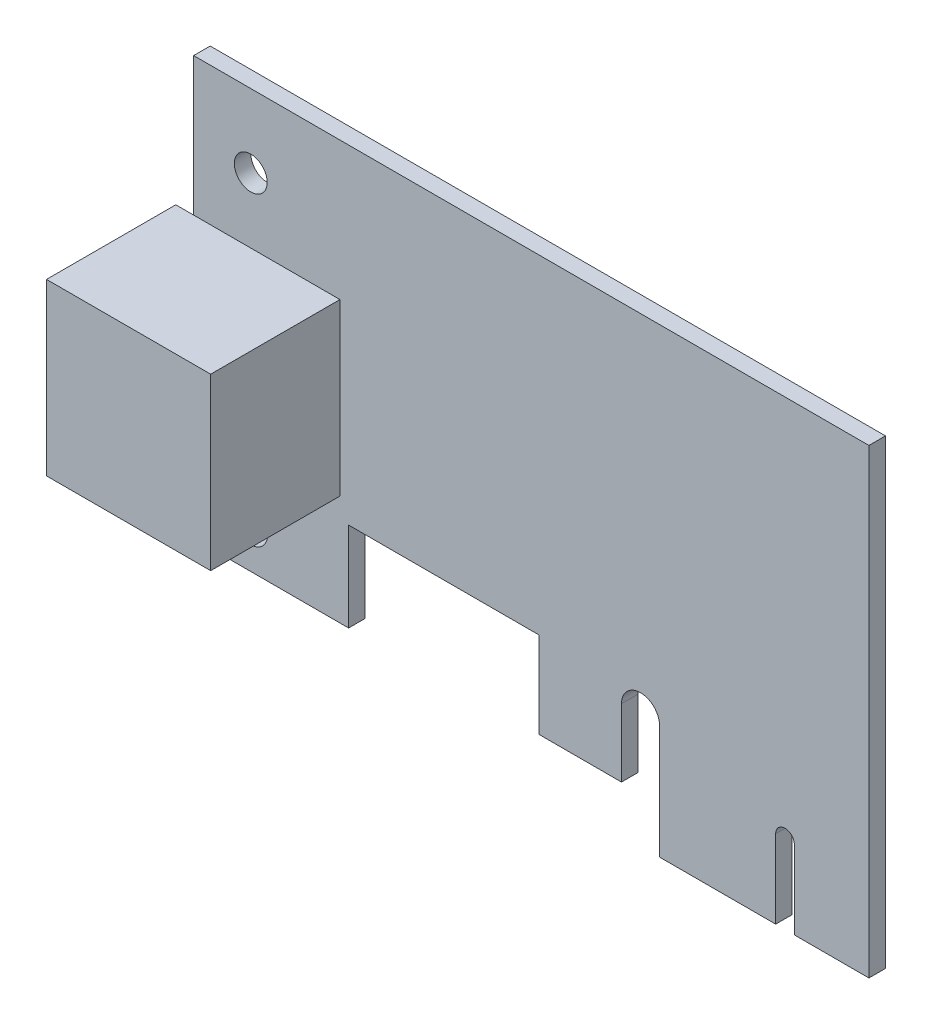
ISO-10303-21;
HEADER;
FILE_DESCRIPTION(('STEP AP214'),'2;1');
FILE_NAME('part.step','',(''),(''),'','','');
FILE_SCHEMA(('AUTOMOTIVE_DESIGN { 1 0 10303 214 1 1 1 1 }'));
ENDSEC;
DATA;
#1=APPLICATION_CONTEXT('core data for automotive mechanical design processes');
#2=APPLICATION_PROTOCOL_DEFINITION('international standard','automotive_design',2000,#1);
#3=PRODUCT_CONTEXT('',#1,'mechanical');
#4=PRODUCT('Part','Part','',(#3));
#5=PRODUCT_RELATED_PRODUCT_CATEGORY('part','',(#4));
#6=PRODUCT_DEFINITION_FORMATION('','',#4);
#7=PRODUCT_DEFINITION_CONTEXT('part definition',#1,'design');
#8=PRODUCT_DEFINITION('design','',#6,#7);
#9=PRODUCT_DEFINITION_SHAPE('','',#8);
#10=(LENGTH_UNIT() NAMED_UNIT(*) SI_UNIT(.MILLI.,.METRE.));
#11=(NAMED_UNIT(*) PLANE_ANGLE_UNIT() SI_UNIT($,.RADIAN.));
#12=(NAMED_UNIT(*) SI_UNIT($,.STERADIAN.) SOLID_ANGLE_UNIT());
#13=UNCERTAINTY_MEASURE_WITH_UNIT(LENGTH_MEASURE(1.E-05),#10,'distance_accuracy_value','');
#14=(GEOMETRIC_REPRESENTATION_CONTEXT(3) GLOBAL_UNCERTAINTY_ASSIGNED_CONTEXT((#13)) GLOBAL_UNIT_ASSIGNED_CONTEXT((#10,
#11,#12)) REPRESENTATION_CONTEXT('',''));
#15=CARTESIAN_POINT('',(0.,0.,0.));
#16=DIRECTION('',(0.,0.,1.));
#17=DIRECTION('',(1.,0.,0.));
#18=AXIS2_PLACEMENT_3D('',#15,#16,#17);
#19=CARTESIAN_POINT('',(43.2181,11.0109,1.6));
#20=DIRECTION('',(0.,0.,1.));
#21=DIRECTION('',(1.,0.,0.));
#22=AXIS2_PLACEMENT_3D('',#19,#20,#21);
#23=PLANE('',#22);
#24=DIRECTION('',(-1.,0.,0.));
#25=VECTOR('',#24,1.);
#26=CARTESIAN_POINT('',(-1.7272,31.242,1.6));
#27=LINE('',#26,#25);
#28=CARTESIAN_POINT('',(14.1478,31.242,1.6));
#29=VERTEX_POINT('',#28);
#30=CARTESIAN_POINT('',(0.,31.242,1.6));
#31=VERTEX_POINT('',#30);
#32=EDGE_CURVE('E65',#29,#31,#27,.T.);
#33=ORIENTED_EDGE('',*,*,#32,.F.);
#34=DIRECTION('',(0.,1.,0.));
#35=VECTOR('',#34,1.);
#36=CARTESIAN_POINT('',(14.1478,31.242,1.6));
#37=LINE('',#36,#35);
#38=CARTESIAN_POINT('',(14.1478,14.7828,1.6));
#39=VERTEX_POINT('',#38);
#40=EDGE_CURVE('E478',#39,#29,#37,.T.);
#41=ORIENTED_EDGE('',*,*,#40,.F.);
#42=DIRECTION('',(1.,0.,0.));
#43=VECTOR('',#42,1.);
#44=CARTESIAN_POINT('',(-1.7272,14.7828,1.6));
#45=LINE('',#44,#43);
#46=CARTESIAN_POINT('',(0.,14.7828,1.6));
#47=VERTEX_POINT('',#46);
#48=EDGE_CURVE('E11',#47,#39,#45,.T.);
#49=ORIENTED_EDGE('',*,*,#48,.F.);
#50=DIRECTION('',(0.,-1.,0.));
#51=VECTOR('',#50,1.);
#52=CARTESIAN_POINT('',(0.,4.15289999999999,1.6));
#53=LINE('',#52,#51);
#54=CARTESIAN_POINT('',(0.,4.15289999999999,1.6));
#55=VERTEX_POINT('',#54);
#56=EDGE_CURVE('E290',#47,#55,#53,.T.);
#57=ORIENTED_EDGE('',*,*,#56,.T.);
#58=DIRECTION('',(1.,0.,0.));
#59=VECTOR('',#58,1.);
#60=CARTESIAN_POINT('',(0.,4.15289999999999,1.6));
#61=LINE('',#60,#59);
#62=CARTESIAN_POINT('',(14.986,4.15289999999999,1.6));
#63=VERTEX_POINT('',#62);
#64=EDGE_CURVE('E294',#55,#63,#61,.T.);
#65=ORIENTED_EDGE('',*,*,#64,.T.);
#66=DIRECTION('',(0.,1.,0.));
#67=VECTOR('',#66,1.);
#68=CARTESIAN_POINT('',(14.986,4.15289999999999,1.6));
#69=LINE('',#68,#67);
#70=CARTESIAN_POINT('',(14.986,12.7762,1.6));
#71=VERTEX_POINT('',#70);
#72=EDGE_CURVE('E298',#63,#71,#69,.T.);
#73=ORIENTED_EDGE('',*,*,#72,.T.);
#74=DIRECTION('',(1.,0.,0.));
#75=VECTOR('',#74,1.);
#76=CARTESIAN_POINT('',(14.986,12.7762,1.6));
#77=LINE('',#76,#75);
#78=CARTESIAN_POINT('',(33.3756,12.7762,1.6));
#79=VERTEX_POINT('',#78);
#80=EDGE_CURVE('E301',#71,#79,#77,.T.);
#81=ORIENTED_EDGE('',*,*,#80,.T.);
#82=DIRECTION('',(0.,-1.,0.));
#83=VECTOR('',#82,1.);
#84=CARTESIAN_POINT('',(33.3756,12.7762,1.6));
#85=LINE('',#84,#83);
#86=CARTESIAN_POINT('',(33.3756,4.445,1.6));
#87=VERTEX_POINT('',#86);
#88=EDGE_CURVE('E304',#79,#87,#85,.T.);
#89=ORIENTED_EDGE('',*,*,#88,.T.);
#90=DIRECTION('',(1.,0.,0.));
#91=VECTOR('',#90,1.);
#92=CARTESIAN_POINT('',(33.3756,4.445,1.6));
#93=LINE('',#92,#91);
#94=CARTESIAN_POINT('',(41.3766,4.445,1.6));
#95=VERTEX_POINT('',#94);
#96=EDGE_CURVE('E307',#87,#95,#93,.T.);
#97=ORIENTED_EDGE('',*,*,#96,.T.);
#98=DIRECTION('',(0.,1.,0.));
#99=VECTOR('',#98,1.);
#100=CARTESIAN_POINT('',(41.3766,4.445,1.6));
#101=LINE('',#100,#99);
#102=CARTESIAN_POINT('',(41.3766,11.0109,1.6));
#103=VERTEX_POINT('',#102);
#104=EDGE_CURVE('E310',#95,#103,#101,.T.);
#105=ORIENTED_EDGE('',*,*,#104,.T.);
#106=CARTESIAN_POINT('',(43.2181,11.0109,1.6));
#107=DIRECTION('',(0.,0.,-1.));
#108=DIRECTION('',(1.,0.,0.));
#109=AXIS2_PLACEMENT_3D('',#106,#107,#108);
#110=CIRCLE('',#109,1.8415);
#111=CARTESIAN_POINT('',(45.0596,11.0109,1.6));
#112=VERTEX_POINT('',#111);
#113=EDGE_CURVE('E313',#103,#112,#110,.T.);
#114=ORIENTED_EDGE('',*,*,#113,.T.);
#115=DIRECTION('',(0.,-1.,0.));
#116=VECTOR('',#115,1.);
#117=CARTESIAN_POINT('',(45.0596,11.0109,1.6));
#118=LINE('',#117,#116);
#119=CARTESIAN_POINT('',(45.0596,0.,1.6));
#120=VERTEX_POINT('',#119);
#121=EDGE_CURVE('E316',#112,#120,#118,.T.);
#122=ORIENTED_EDGE('',*,*,#121,.T.);
#123=DIRECTION('',(1.,0.,0.));
#124=VECTOR('',#123,1.);
#125=CARTESIAN_POINT('',(45.0596,0.,1.6));
#126=LINE('',#125,#124);
#127=CARTESIAN_POINT('',(56.2864,0.,1.6));
#128=VERTEX_POINT('',#127);
#129=EDGE_CURVE('E319',#120,#128,#126,.T.);
#130=ORIENTED_EDGE('',*,*,#129,.T.);
#131=DIRECTION('',(0.,1.,0.));
#132=VECTOR('',#131,1.);
#133=CARTESIAN_POINT('',(56.2864,0.,1.6));
#134=LINE('',#133,#132);
#135=CARTESIAN_POINT('',(56.2864,7.58190000000001,1.6));
#136=VERTEX_POINT('',#135);
#137=EDGE_CURVE('E322',#128,#136,#134,.T.);
#138=ORIENTED_EDGE('',*,*,#137,.T.);
#139=CARTESIAN_POINT('',(57.1881,7.58190000000001,1.6));
#140=DIRECTION('',(0.,0.,-1.));
#141=DIRECTION('',(1.,0.,0.));
#142=AXIS2_PLACEMENT_3D('',#139,#140,#141);
#143=CIRCLE('',#142,0.901699999999998);
#144=CARTESIAN_POINT('',(58.0898,7.58190000000001,1.6));
#145=VERTEX_POINT('',#144);
#146=EDGE_CURVE('E325',#136,#145,#143,.T.);
#147=ORIENTED_EDGE('',*,*,#146,.T.);
#148=DIRECTION('',(0.,-1.,0.));
#149=VECTOR('',#148,1.);
#150=CARTESIAN_POINT('',(58.0898,7.58190000000001,1.6));
#151=LINE('',#150,#149);
#152=CARTESIAN_POINT('',(58.0898,0.,1.6));
#153=VERTEX_POINT('',#152);
#154=EDGE_CURVE('E328',#145,#153,#151,.T.);
#155=ORIENTED_EDGE('',*,*,#154,.T.);
#156=DIRECTION('',(1.,0.,0.));
#157=VECTOR('',#156,1.);
#158=CARTESIAN_POINT('',(58.0898,0.,1.6));
#159=LINE('',#158,#157);
#160=CARTESIAN_POINT('',(65.3034,0.,1.6));
#161=VERTEX_POINT('',#160);
#162=EDGE_CURVE('E331',#153,#161,#159,.T.);
#163=ORIENTED_EDGE('',*,*,#162,.T.);
#164=DIRECTION('',(0.,1.,0.));
#165=VECTOR('',#164,1.);
#166=CARTESIAN_POINT('',(65.3034,0.,1.6));
#167=LINE('',#166,#165);
#168=CARTESIAN_POINT('',(65.3034,44.6024,1.6));
#169=VERTEX_POINT('',#168);
#170=EDGE_CURVE('E282',#161,#169,#167,.T.);
#171=ORIENTED_EDGE('',*,*,#170,.T.);
#172=DIRECTION('',(-1.,0.,0.));
#173=VECTOR('',#172,1.);
#174=CARTESIAN_POINT('',(0.,44.6024,1.6));
#175=LINE('',#174,#173);
#176=CARTESIAN_POINT('',(0.,44.6024,1.6));
#177=VERTEX_POINT('',#176);
#178=EDGE_CURVE('E286',#169,#177,#175,.T.);
#179=ORIENTED_EDGE('',*,*,#178,.T.);
#180=EDGE_CURVE('E291',#177,#31,#53,.T.);
#181=ORIENTED_EDGE('',*,*,#180,.T.);
#182=EDGE_LOOP('',(#33,#41,#49,#57,#65,#73,#81,#89,#97,#105,#114,#122,#130,#138,#147,#155,#163,
#171,#179,#181));
#183=FACE_BOUND('',#182,.T.);
#184=CARTESIAN_POINT('',(5.5245,37.5285,1.6));
#185=DIRECTION('',(0.,0.,1.));
#186=DIRECTION('',(1.,0.,0.));
#187=AXIS2_PLACEMENT_3D('',#184,#185,#186);
#188=CIRCLE('',#187,1.5875);
#189=CARTESIAN_POINT('',(7.112,37.5285,1.6));
#190=VERTEX_POINT('',#189);
#191=EDGE_CURVE('E274',#190,#190,#188,.T.);
#192=ORIENTED_EDGE('',*,*,#191,.F.);
#193=EDGE_LOOP('',(#192));
#194=FACE_BOUND('',#193,.T.);
#195=CARTESIAN_POINT('',(5.55,7.98829999999999,1.6));
#196=DIRECTION('',(0.,0.,1.));
#197=DIRECTION('',(1.,0.,0.));
#198=AXIS2_PLACEMENT_3D('',#195,#196,#197);
#199=CIRCLE('',#198,1.5875);
#200=CARTESIAN_POINT('',(7.1375,7.98829999999999,1.6));
#201=VERTEX_POINT('',#200);
#202=EDGE_CURVE('E263',#201,#201,#199,.T.);
#203=ORIENTED_EDGE('',*,*,#202,.F.);
#204=EDGE_LOOP('',(#203));
#205=FACE_BOUND('',#204,.T.);
#206=ADVANCED_FACE('F44',(#183,#194,#205),#23,.T.);
#207=CARTESIAN_POINT('',(43.2181,11.0109,0.));
#208=DIRECTION('',(0.,0.,1.));
#209=DIRECTION('',(1.,0.,0.));
#210=AXIS2_PLACEMENT_3D('',#207,#208,#209);
#211=PLANE('',#210);
#212=DIRECTION('',(0.,1.,0.));
#213=VECTOR('',#212,1.);
#214=CARTESIAN_POINT('',(65.3034,0.,0.));
#215=LINE('',#214,#213);
#216=CARTESIAN_POINT('',(65.3034,0.,0.));
#217=VERTEX_POINT('',#216);
#218=CARTESIAN_POINT('',(65.3034,44.6024,0.));
#219=VERTEX_POINT('',#218);
#220=EDGE_CURVE('E278',#217,#219,#215,.T.);
#221=ORIENTED_EDGE('',*,*,#220,.F.);
#222=DIRECTION('',(1.,0.,0.));
#223=VECTOR('',#222,1.);
#224=CARTESIAN_POINT('',(58.0898,0.,0.));
#225=LINE('',#224,#223);
#226=CARTESIAN_POINT('',(58.0898,0.,0.));
#227=VERTEX_POINT('',#226);
#228=EDGE_CURVE('E287',#227,#217,#225,.T.);
#229=ORIENTED_EDGE('',*,*,#228,.F.);
#230=DIRECTION('',(0.,-1.,0.));
#231=VECTOR('',#230,1.);
#232=CARTESIAN_POINT('',(58.0898,7.58190000000001,0.));
#233=LINE('',#232,#231);
#234=CARTESIAN_POINT('',(58.0898,7.58190000000001,0.));
#235=VERTEX_POINT('',#234);
#236=EDGE_CURVE('E377',#235,#227,#233,.T.);
#237=ORIENTED_EDGE('',*,*,#236,.F.);
#238=CARTESIAN_POINT('',(57.1881,7.58190000000001,0.));
#239=DIRECTION('',(0.,0.,-1.));
#240=DIRECTION('',(1.,0.,0.));
#241=AXIS2_PLACEMENT_3D('',#238,#239,#240);
#242=CIRCLE('',#241,0.901699999999998);
#243=CARTESIAN_POINT('',(56.2864,7.58190000000001,0.));
#244=VERTEX_POINT('',#243);
#245=EDGE_CURVE('E374',#244,#235,#242,.T.);
#246=ORIENTED_EDGE('',*,*,#245,.F.);
#247=DIRECTION('',(0.,1.,0.));
#248=VECTOR('',#247,1.);
#249=CARTESIAN_POINT('',(56.2864,0.,0.));
#250=LINE('',#249,#248);
#251=CARTESIAN_POINT('',(56.2864,0.,0.));
#252=VERTEX_POINT('',#251);
#253=EDGE_CURVE('E371',#252,#244,#250,.T.);
#254=ORIENTED_EDGE('',*,*,#253,.F.);
#255=DIRECTION('',(1.,0.,0.));
#256=VECTOR('',#255,1.);
#257=CARTESIAN_POINT('',(45.0596,0.,0.));
#258=LINE('',#257,#256);
#259=CARTESIAN_POINT('',(45.0596,0.,0.));
#260=VERTEX_POINT('',#259);
#261=EDGE_CURVE('E368',#260,#252,#258,.T.);
#262=ORIENTED_EDGE('',*,*,#261,.F.);
#263=DIRECTION('',(0.,-1.,0.));
#264=VECTOR('',#263,1.);
#265=CARTESIAN_POINT('',(45.0596,11.0109,0.));
#266=LINE('',#265,#264);
#267=CARTESIAN_POINT('',(45.0596,11.0109,0.));
#268=VERTEX_POINT('',#267);
#269=EDGE_CURVE('E365',#268,#260,#266,.T.);
#270=ORIENTED_EDGE('',*,*,#269,.F.);
#271=CARTESIAN_POINT('',(43.2181,11.0109,0.));
#272=DIRECTION('',(0.,0.,-1.));
#273=DIRECTION('',(1.,0.,0.));
#274=AXIS2_PLACEMENT_3D('',#271,#272,#273);
#275=CIRCLE('',#274,1.8415);
#276=CARTESIAN_POINT('',(41.3766,11.0109,0.));
#277=VERTEX_POINT('',#276);
#278=EDGE_CURVE('E362',#277,#268,#275,.T.);
#279=ORIENTED_EDGE('',*,*,#278,.F.);
#280=DIRECTION('',(0.,1.,0.));
#281=VECTOR('',#280,1.);
#282=CARTESIAN_POINT('',(41.3766,4.445,0.));
#283=LINE('',#282,#281);
#284=CARTESIAN_POINT('',(41.3766,4.445,0.));
#285=VERTEX_POINT('',#284);
#286=EDGE_CURVE('E359',#285,#277,#283,.T.);
#287=ORIENTED_EDGE('',*,*,#286,.F.);
#288=DIRECTION('',(1.,0.,0.));
#289=VECTOR('',#288,1.);
#290=CARTESIAN_POINT('',(33.3756,4.445,0.));
#291=LINE('',#290,#289);
#292=CARTESIAN_POINT('',(33.3756,4.445,0.));
#293=VERTEX_POINT('',#292);
#294=EDGE_CURVE('E356',#293,#285,#291,.T.);
#295=ORIENTED_EDGE('',*,*,#294,.F.);
#296=DIRECTION('',(0.,-1.,0.));
#297=VECTOR('',#296,1.);
#298=CARTESIAN_POINT('',(33.3756,12.7762,0.));
#299=LINE('',#298,#297);
#300=CARTESIAN_POINT('',(33.3756,12.7762,0.));
#301=VERTEX_POINT('',#300);
#302=EDGE_CURVE('E353',#301,#293,#299,.T.);
#303=ORIENTED_EDGE('',*,*,#302,.F.);
#304=DIRECTION('',(1.,0.,0.));
#305=VECTOR('',#304,1.);
#306=CARTESIAN_POINT('',(14.986,12.7762,0.));
#307=LINE('',#306,#305);
#308=CARTESIAN_POINT('',(14.986,12.7762,0.));
#309=VERTEX_POINT('',#308);
#310=EDGE_CURVE('E350',#309,#301,#307,.T.);
#311=ORIENTED_EDGE('',*,*,#310,.F.);
#312=DIRECTION('',(0.,1.,0.));
#313=VECTOR('',#312,1.);
#314=CARTESIAN_POINT('',(14.986,4.15289999999999,0.));
#315=LINE('',#314,#313);
#316=CARTESIAN_POINT('',(14.986,4.15289999999999,0.));
#317=VERTEX_POINT('',#316);
#318=EDGE_CURVE('E347',#317,#309,#315,.T.);
#319=ORIENTED_EDGE('',*,*,#318,.F.);
#320=DIRECTION('',(1.,0.,0.));
#321=VECTOR('',#320,1.);
#322=CARTESIAN_POINT('',(0.,4.15289999999999,0.));
#323=LINE('',#322,#321);
#324=CARTESIAN_POINT('',(0.,4.15289999999999,0.));
#325=VERTEX_POINT('',#324);
#326=EDGE_CURVE('E344',#325,#317,#323,.T.);
#327=ORIENTED_EDGE('',*,*,#326,.F.);
#328=DIRECTION('',(0.,-1.,0.));
#329=VECTOR('',#328,1.);
#330=CARTESIAN_POINT('',(0.,4.15289999999999,0.));
#331=LINE('',#330,#329);
#332=CARTESIAN_POINT('',(0.,44.6024,0.));
#333=VERTEX_POINT('',#332);
#334=EDGE_CURVE('E341',#333,#325,#331,.T.);
#335=ORIENTED_EDGE('',*,*,#334,.F.);
#336=DIRECTION('',(-1.,0.,0.));
#337=VECTOR('',#336,1.);
#338=CARTESIAN_POINT('',(0.,44.6024,0.));
#339=LINE('',#338,#337);
#340=EDGE_CURVE('E338',#219,#333,#339,.T.);
#341=ORIENTED_EDGE('',*,*,#340,.F.);
#342=EDGE_LOOP('',(#221,#229,#237,#246,#254,#262,#270,#279,#287,#295,#303,#311,#319,#327,#335,#341));
#343=FACE_BOUND('',#342,.T.);
#344=CARTESIAN_POINT('',(5.5245,37.5285,0.));
#345=DIRECTION('',(0.,0.,1.));
#346=DIRECTION('',(1.,0.,0.));
#347=AXIS2_PLACEMENT_3D('',#344,#345,#346);
#348=CIRCLE('',#347,1.5875);
#349=CARTESIAN_POINT('',(7.112,37.5285,0.));
#350=VERTEX_POINT('',#349);
#351=EDGE_CURVE('E272',#350,#350,#348,.T.);
#352=ORIENTED_EDGE('',*,*,#351,.T.);
#353=EDGE_LOOP('',(#352));
#354=FACE_BOUND('',#353,.T.);
#355=CARTESIAN_POINT('',(5.55,7.98829999999999,0.));
#356=DIRECTION('',(0.,0.,1.));
#357=DIRECTION('',(1.,0.,0.));
#358=AXIS2_PLACEMENT_3D('',#355,#356,#357);
#359=CIRCLE('',#358,1.5875);
#360=CARTESIAN_POINT('',(7.1375,7.98829999999999,0.));
#361=VERTEX_POINT('',#360);
#362=EDGE_CURVE('E258',#361,#361,#359,.T.);
#363=ORIENTED_EDGE('',*,*,#362,.T.);
#364=EDGE_LOOP('',(#363));
#365=FACE_BOUND('',#364,.T.);
#366=ADVANCED_FACE('F456',(#343,#354,#365),#211,.F.);
#367=CARTESIAN_POINT('',(65.3034,0.,1.6));
#368=DIRECTION('',(-1.,0.,0.));
#369=DIRECTION('',(0.,0.,1.));
#370=AXIS2_PLACEMENT_3D('',#367,#368,#369);
#371=PLANE('',#370);
#372=ORIENTED_EDGE('',*,*,#220,.T.);
#373=DIRECTION('',(0.,0.,-1.));
#374=VECTOR('',#373,1.);
#375=CARTESIAN_POINT('',(65.3034,44.6024,1.6));
#376=LINE('',#375,#374);
#377=EDGE_CURVE('E48',#169,#219,#376,.T.);
#378=ORIENTED_EDGE('',*,*,#377,.F.);
#379=ORIENTED_EDGE('',*,*,#170,.F.);
#380=DIRECTION('',(0.,0.,-1.));
#381=VECTOR('',#380,1.);
#382=CARTESIAN_POINT('',(65.3034,0.,1.6));
#383=LINE('',#382,#381);
#384=EDGE_CURVE('E334',#161,#217,#383,.T.);
#385=ORIENTED_EDGE('',*,*,#384,.T.);
#386=EDGE_LOOP('',(#372,#378,#379,#385));
#387=FACE_BOUND('',#386,.T.);
#388=ADVANCED_FACE('F46',(#387),#371,.F.);
#389=CARTESIAN_POINT('',(0.,44.6024,1.6));
#390=DIRECTION('',(0.,-1.,0.));
#391=DIRECTION('',(0.,0.,-1.));
#392=AXIS2_PLACEMENT_3D('',#389,#390,#391);
#393=PLANE('',#392);
#394=ORIENTED_EDGE('',*,*,#340,.T.);
#395=DIRECTION('',(0.,0.,-1.));
#396=VECTOR('',#395,1.);
#397=CARTESIAN_POINT('',(0.,44.6024,1.6));
#398=LINE('',#397,#396);
#399=EDGE_CURVE('E436',#177,#333,#398,.T.);
#400=ORIENTED_EDGE('',*,*,#399,.F.);
#401=ORIENTED_EDGE('',*,*,#178,.F.);
#402=ORIENTED_EDGE('',*,*,#377,.T.);
#403=EDGE_LOOP('',(#394,#400,#401,#402));
#404=FACE_BOUND('',#403,.T.);
#405=ADVANCED_FACE('F449',(#404),#393,.F.);
#406=CARTESIAN_POINT('',(0.,4.15289999999999,1.6));
#407=DIRECTION('',(1.,0.,0.));
#408=DIRECTION('',(0.,0.,-1.));
#409=AXIS2_PLACEMENT_3D('',#406,#407,#408);
#410=PLANE('',#409);
#411=ORIENTED_EDGE('',*,*,#334,.T.);
#412=DIRECTION('',(0.,0.,-1.));
#413=VECTOR('',#412,1.);
#414=CARTESIAN_POINT('',(0.,4.15289999999999,1.6));
#415=LINE('',#414,#413);
#416=EDGE_CURVE('E433',#55,#325,#415,.T.);
#417=ORIENTED_EDGE('',*,*,#416,.F.);
#418=ORIENTED_EDGE('',*,*,#56,.F.);
#419=EDGE_CURVE('E295',#31,#47,#53,.T.);
#420=ORIENTED_EDGE('',*,*,#419,.F.);
#421=ORIENTED_EDGE('',*,*,#180,.F.);
#422=ORIENTED_EDGE('',*,*,#399,.T.);
#423=EDGE_LOOP('',(#411,#417,#418,#420,#421,#422));
#424=FACE_BOUND('',#423,.T.);
#425=ADVANCED_FACE('F462',(#424),#410,.F.);
#426=CARTESIAN_POINT('',(0.,4.15289999999999,1.6));
#427=DIRECTION('',(0.,1.,0.));
#428=DIRECTION('',(0.,0.,1.));
#429=AXIS2_PLACEMENT_3D('',#426,#427,#428);
#430=PLANE('',#429);
#431=ORIENTED_EDGE('',*,*,#326,.T.);
#432=DIRECTION('',(0.,0.,-1.));
#433=VECTOR('',#432,1.);
#434=CARTESIAN_POINT('',(14.986,4.15289999999999,1.6));
#435=LINE('',#434,#433);
#436=EDGE_CURVE('E429',#63,#317,#435,.T.);
#437=ORIENTED_EDGE('',*,*,#436,.F.);
#438=ORIENTED_EDGE('',*,*,#64,.F.);
#439=ORIENTED_EDGE('',*,*,#416,.T.);
#440=EDGE_LOOP('',(#431,#437,#438,#439));
#441=FACE_BOUND('',#440,.T.);
#442=ADVANCED_FACE('F465',(#441),#430,.F.);
#443=CARTESIAN_POINT('',(14.986,4.15289999999999,1.6));
#444=DIRECTION('',(-1.,0.,0.));
#445=DIRECTION('',(0.,0.,1.));
#446=AXIS2_PLACEMENT_3D('',#443,#444,#445);
#447=PLANE('',#446);
#448=ORIENTED_EDGE('',*,*,#318,.T.);
#449=DIRECTION('',(0.,0.,-1.));
#450=VECTOR('',#449,1.);
#451=CARTESIAN_POINT('',(14.986,12.7762,1.6));
#452=LINE('',#451,#450);
#453=EDGE_CURVE('E425',#71,#309,#452,.T.);
#454=ORIENTED_EDGE('',*,*,#453,.F.);
#455=ORIENTED_EDGE('',*,*,#72,.F.);
#456=ORIENTED_EDGE('',*,*,#436,.T.);
#457=EDGE_LOOP('',(#448,#454,#455,#456));
#458=FACE_BOUND('',#457,.T.);
#459=ADVANCED_FACE('F558',(#458),#447,.F.);
#460=CARTESIAN_POINT('',(14.986,12.7762,1.6));
#461=DIRECTION('',(0.,1.,0.));
#462=DIRECTION('',(0.,0.,1.));
#463=AXIS2_PLACEMENT_3D('',#460,#461,#462);
#464=PLANE('',#463);
#465=ORIENTED_EDGE('',*,*,#310,.T.);
#466=DIRECTION('',(0.,0.,-1.));
#467=VECTOR('',#466,1.);
#468=CARTESIAN_POINT('',(33.3756,12.7762,1.6));
#469=LINE('',#468,#467);
#470=EDGE_CURVE('E421',#79,#301,#469,.T.);
#471=ORIENTED_EDGE('',*,*,#470,.F.);
#472=ORIENTED_EDGE('',*,*,#80,.F.);
#473=ORIENTED_EDGE('',*,*,#453,.T.);
#474=EDGE_LOOP('',(#465,#471,#472,#473));
#475=FACE_BOUND('',#474,.T.);
#476=ADVANCED_FACE('F554',(#475),#464,.F.);
#477=CARTESIAN_POINT('',(33.3756,12.7762,1.6));
#478=DIRECTION('',(1.,0.,0.));
#479=DIRECTION('',(0.,0.,-1.));
#480=AXIS2_PLACEMENT_3D('',#477,#478,#479);
#481=PLANE('',#480);
#482=ORIENTED_EDGE('',*,*,#302,.T.);
#483=DIRECTION('',(0.,0.,-1.));
#484=VECTOR('',#483,1.);
#485=CARTESIAN_POINT('',(33.3756,4.445,1.6));
#486=LINE('',#485,#484);
#487=EDGE_CURVE('E417',#87,#293,#486,.T.);
#488=ORIENTED_EDGE('',*,*,#487,.F.);
#489=ORIENTED_EDGE('',*,*,#88,.F.);
#490=ORIENTED_EDGE('',*,*,#470,.T.);
#491=EDGE_LOOP('',(#482,#488,#489,#490));
#492=FACE_BOUND('',#491,.T.);
#493=ADVANCED_FACE('F550',(#492),#481,.F.);
#494=CARTESIAN_POINT('',(33.3756,4.445,1.6));
#495=DIRECTION('',(0.,1.,0.));
#496=DIRECTION('',(0.,0.,1.));
#497=AXIS2_PLACEMENT_3D('',#494,#495,#496);
#498=PLANE('',#497);
#499=ORIENTED_EDGE('',*,*,#294,.T.);
#500=DIRECTION('',(0.,0.,-1.));
#501=VECTOR('',#500,1.);
#502=CARTESIAN_POINT('',(41.3766,4.445,1.6));
#503=LINE('',#502,#501);
#504=EDGE_CURVE('E413',#95,#285,#503,.T.);
#505=ORIENTED_EDGE('',*,*,#504,.F.);
#506=ORIENTED_EDGE('',*,*,#96,.F.);
#507=ORIENTED_EDGE('',*,*,#487,.T.);
#508=EDGE_LOOP('',(#499,#505,#506,#507));
#509=FACE_BOUND('',#508,.T.);
#510=ADVANCED_FACE('F546',(#509),#498,.F.);
#511=CARTESIAN_POINT('',(41.3766,4.445,1.6));
#512=DIRECTION('',(-1.,0.,0.));
#513=DIRECTION('',(0.,0.,1.));
#514=AXIS2_PLACEMENT_3D('',#511,#512,#513);
#515=PLANE('',#514);
#516=ORIENTED_EDGE('',*,*,#286,.T.);
#517=DIRECTION('',(0.,0.,-1.));
#518=VECTOR('',#517,1.);
#519=CARTESIAN_POINT('',(41.3766,11.0109,1.6));
#520=LINE('',#519,#518);
#521=EDGE_CURVE('E409',#103,#277,#520,.T.);
#522=ORIENTED_EDGE('',*,*,#521,.F.);
#523=ORIENTED_EDGE('',*,*,#104,.F.);
#524=ORIENTED_EDGE('',*,*,#504,.T.);
#525=EDGE_LOOP('',(#516,#522,#523,#524));
#526=FACE_BOUND('',#525,.T.);
#527=ADVANCED_FACE('F542',(#526),#515,.F.);
#528=CARTESIAN_POINT('',(43.2181,11.0109,1.6));
#529=DIRECTION('',(0.,0.,-1.));
#530=DIRECTION('',(-1.,0.,0.));
#531=AXIS2_PLACEMENT_3D('',#528,#529,#530);
#532=CYLINDRICAL_SURFACE('',#531,1.8415);
#533=ORIENTED_EDGE('',*,*,#278,.T.);
#534=DIRECTION('',(0.,0.,-1.));
#535=VECTOR('',#534,1.);
#536=CARTESIAN_POINT('',(45.0596,11.0109,1.6));
#537=LINE('',#536,#535);
#538=EDGE_CURVE('E405',#112,#268,#537,.T.);
#539=ORIENTED_EDGE('',*,*,#538,.F.);
#540=ORIENTED_EDGE('',*,*,#113,.F.);
#541=ORIENTED_EDGE('',*,*,#521,.T.);
#542=EDGE_LOOP('',(#533,#539,#540,#541));
#543=FACE_BOUND('',#542,.T.);
#544=ADVANCED_FACE('F538',(#543),#532,.F.);
#545=CARTESIAN_POINT('',(45.0596,11.0109,1.6));
#546=DIRECTION('',(1.,0.,0.));
#547=DIRECTION('',(0.,0.,-1.));
#548=AXIS2_PLACEMENT_3D('',#545,#546,#547);
#549=PLANE('',#548);
#550=ORIENTED_EDGE('',*,*,#269,.T.);
#551=DIRECTION('',(0.,0.,-1.));
#552=VECTOR('',#551,1.);
#553=CARTESIAN_POINT('',(45.0596,0.,1.6));
#554=LINE('',#553,#552);
#555=EDGE_CURVE('E401',#120,#260,#554,.T.);
#556=ORIENTED_EDGE('',*,*,#555,.F.);
#557=ORIENTED_EDGE('',*,*,#121,.F.);
#558=ORIENTED_EDGE('',*,*,#538,.T.);
#559=EDGE_LOOP('',(#550,#556,#557,#558));
#560=FACE_BOUND('',#559,.T.);
#561=ADVANCED_FACE('F534',(#560),#549,.F.);
#562=CARTESIAN_POINT('',(45.0596,0.,1.6));
#563=DIRECTION('',(0.,1.,0.));
#564=DIRECTION('',(0.,0.,1.));
#565=AXIS2_PLACEMENT_3D('',#562,#563,#564);
#566=PLANE('',#565);
#567=ORIENTED_EDGE('',*,*,#261,.T.);
#568=DIRECTION('',(0.,0.,-1.));
#569=VECTOR('',#568,1.);
#570=CARTESIAN_POINT('',(56.2864,0.,1.6));
#571=LINE('',#570,#569);
#572=EDGE_CURVE('E397',#128,#252,#571,.T.);
#573=ORIENTED_EDGE('',*,*,#572,.F.);
#574=ORIENTED_EDGE('',*,*,#129,.F.);
#575=ORIENTED_EDGE('',*,*,#555,.T.);
#576=EDGE_LOOP('',(#567,#573,#574,#575));
#577=FACE_BOUND('',#576,.T.);
#578=ADVANCED_FACE('F530',(#577),#566,.F.);
#579=CARTESIAN_POINT('',(56.2864,0.,1.6));
#580=DIRECTION('',(-1.,0.,0.));
#581=DIRECTION('',(0.,0.,1.));
#582=AXIS2_PLACEMENT_3D('',#579,#580,#581);
#583=PLANE('',#582);
#584=ORIENTED_EDGE('',*,*,#253,.T.);
#585=DIRECTION('',(0.,0.,-1.));
#586=VECTOR('',#585,1.);
#587=CARTESIAN_POINT('',(56.2864,7.58190000000001,1.6));
#588=LINE('',#587,#586);
#589=EDGE_CURVE('E393',#136,#244,#588,.T.);
#590=ORIENTED_EDGE('',*,*,#589,.F.);
#591=ORIENTED_EDGE('',*,*,#137,.F.);
#592=ORIENTED_EDGE('',*,*,#572,.T.);
#593=EDGE_LOOP('',(#584,#590,#591,#592));
#594=FACE_BOUND('',#593,.T.);
#595=ADVANCED_FACE('F526',(#594),#583,.F.);
#596=CARTESIAN_POINT('',(57.1881,7.58190000000001,1.6));
#597=DIRECTION('',(0.,0.,-1.));
#598=DIRECTION('',(-1.,0.,0.));
#599=AXIS2_PLACEMENT_3D('',#596,#597,#598);
#600=CYLINDRICAL_SURFACE('',#599,0.901699999999998);
#601=ORIENTED_EDGE('',*,*,#245,.T.);
#602=DIRECTION('',(0.,0.,-1.));
#603=VECTOR('',#602,1.);
#604=CARTESIAN_POINT('',(58.0898,7.58190000000001,1.6));
#605=LINE('',#604,#603);
#606=EDGE_CURVE('E389',#145,#235,#605,.T.);
#607=ORIENTED_EDGE('',*,*,#606,.F.);
#608=ORIENTED_EDGE('',*,*,#146,.F.);
#609=ORIENTED_EDGE('',*,*,#589,.T.);
#610=EDGE_LOOP('',(#601,#607,#608,#609));
#611=FACE_BOUND('',#610,.T.);
#612=ADVANCED_FACE('F522',(#611),#600,.F.);
#613=CARTESIAN_POINT('',(58.0898,7.58190000000001,1.6));
#614=DIRECTION('',(1.,0.,0.));
#615=DIRECTION('',(0.,0.,-1.));
#616=AXIS2_PLACEMENT_3D('',#613,#614,#615);
#617=PLANE('',#616);
#618=ORIENTED_EDGE('',*,*,#236,.T.);
#619=DIRECTION('',(0.,0.,-1.));
#620=VECTOR('',#619,1.);
#621=CARTESIAN_POINT('',(58.0898,0.,1.6));
#622=LINE('',#621,#620);
#623=EDGE_CURVE('E385',#153,#227,#622,.T.);
#624=ORIENTED_EDGE('',*,*,#623,.F.);
#625=ORIENTED_EDGE('',*,*,#154,.F.);
#626=ORIENTED_EDGE('',*,*,#606,.T.);
#627=EDGE_LOOP('',(#618,#624,#625,#626));
#628=FACE_BOUND('',#627,.T.);
#629=ADVANCED_FACE('F518',(#628),#617,.F.);
#630=CARTESIAN_POINT('',(58.0898,0.,1.6));
#631=DIRECTION('',(0.,1.,0.));
#632=DIRECTION('',(0.,0.,1.));
#633=AXIS2_PLACEMENT_3D('',#630,#631,#632);
#634=PLANE('',#633);
#635=ORIENTED_EDGE('',*,*,#228,.T.);
#636=ORIENTED_EDGE('',*,*,#384,.F.);
#637=ORIENTED_EDGE('',*,*,#162,.F.);
#638=ORIENTED_EDGE('',*,*,#623,.T.);
#639=EDGE_LOOP('',(#635,#636,#637,#638));
#640=FACE_BOUND('',#639,.T.);
#641=ADVANCED_FACE('F515',(#640),#634,.F.);
#642=CARTESIAN_POINT('',(5.5245,37.5285,1.6));
#643=DIRECTION('',(0.,0.,-1.));
#644=DIRECTION('',(-1.,0.,0.));
#645=AXIS2_PLACEMENT_3D('',#642,#643,#644);
#646=CYLINDRICAL_SURFACE('',#645,1.5875);
#647=ORIENTED_EDGE('',*,*,#191,.T.);
#648=EDGE_LOOP('',(#647));
#649=FACE_BOUND('',#648,.T.);
#650=ORIENTED_EDGE('',*,*,#351,.F.);
#651=EDGE_LOOP('',(#650));
#652=FACE_BOUND('',#651,.T.);
#653=ADVANCED_FACE('F512',(#649,#652),#646,.F.);
#654=CARTESIAN_POINT('',(5.55,7.98829999999999,1.6));
#655=DIRECTION('',(0.,0.,-1.));
#656=DIRECTION('',(-1.,0.,0.));
#657=AXIS2_PLACEMENT_3D('',#654,#655,#656);
#658=CYLINDRICAL_SURFACE('',#657,1.5875);
#659=ORIENTED_EDGE('',*,*,#202,.T.);
#660=EDGE_LOOP('',(#659));
#661=FACE_BOUND('',#660,.T.);
#662=ORIENTED_EDGE('',*,*,#362,.F.);
#663=EDGE_LOOP('',(#662));
#664=FACE_BOUND('',#663,.T.);
#665=ADVANCED_FACE('F648',(#661,#664),#658,.F.);
#666=CARTESIAN_POINT('',(0.,0.,1.6));
#667=DIRECTION('',(0.,0.,1.));
#668=DIRECTION('',(1.,0.,0.));
#669=AXIS2_PLACEMENT_3D('',#666,#667,#668);
#670=PLANE('',#669);
#671=CARTESIAN_POINT('',(-1.7272,31.242,1.6));
#672=VERTEX_POINT('',#671);
#673=EDGE_CURVE('E477',#31,#672,#27,.T.);
#674=ORIENTED_EDGE('',*,*,#673,.F.);
#675=ORIENTED_EDGE('',*,*,#419,.T.);
#676=CARTESIAN_POINT('',(-1.7272,14.7828,1.6));
#677=VERTEX_POINT('',#676);
#678=EDGE_CURVE('E55',#677,#47,#45,.T.);
#679=ORIENTED_EDGE('',*,*,#678,.F.);
#680=DIRECTION('',(0.,-1.,0.));
#681=VECTOR('',#680,1.);
#682=CARTESIAN_POINT('',(-1.7272,31.242,1.6));
#683=LINE('',#682,#681);
#684=EDGE_CURVE('E256',#672,#677,#683,.T.);
#685=ORIENTED_EDGE('',*,*,#684,.F.);
#686=EDGE_LOOP('',(#674,#675,#679,#685));
#687=FACE_BOUND('',#686,.T.);
#688=ADVANCED_FACE('F476',(#687),#670,.F.);
#689=CARTESIAN_POINT('',(-1.7272,31.242,14.1));
#690=DIRECTION('',(1.,0.,0.));
#691=DIRECTION('',(0.,1.,0.));
#692=AXIS2_PLACEMENT_3D('',#689,#690,#691);
#693=PLANE('',#692);
#694=ORIENTED_EDGE('',*,*,#684,.T.);
#695=DIRECTION('',(0.,0.,-1.));
#696=VECTOR('',#695,1.);
#697=CARTESIAN_POINT('',(-1.7272,14.7828,14.1));
#698=LINE('',#697,#696);
#699=CARTESIAN_POINT('',(-1.7272,14.7828,14.1));
#700=VERTEX_POINT('',#699);
#701=EDGE_CURVE('E235',#700,#677,#698,.T.);
#702=ORIENTED_EDGE('',*,*,#701,.F.);
#703=DIRECTION('',(0.,-1.,0.));
#704=VECTOR('',#703,1.);
#705=CARTESIAN_POINT('',(-1.7272,31.242,14.1));
#706=LINE('',#705,#704);
#707=CARTESIAN_POINT('',(-1.7272,31.242,14.1));
#708=VERTEX_POINT('',#707);
#709=EDGE_CURVE('E243',#708,#700,#706,.T.);
#710=ORIENTED_EDGE('',*,*,#709,.F.);
#711=DIRECTION('',(0.,0.,-1.));
#712=VECTOR('',#711,1.);
#713=CARTESIAN_POINT('',(-1.7272,31.242,14.1));
#714=LINE('',#713,#712);
#715=EDGE_CURVE('E487',#708,#672,#714,.T.);
#716=ORIENTED_EDGE('',*,*,#715,.T.);
#717=EDGE_LOOP('',(#694,#702,#710,#716));
#718=FACE_BOUND('',#717,.T.);
#719=ADVANCED_FACE('F254',(#718),#693,.F.);
#720=CARTESIAN_POINT('',(-1.7272,14.7828,14.1));
#721=DIRECTION('',(0.,1.,0.));
#722=DIRECTION('',(0.,0.,1.));
#723=AXIS2_PLACEMENT_3D('',#720,#721,#722);
#724=PLANE('',#723);
#725=ORIENTED_EDGE('',*,*,#678,.T.);
#726=ORIENTED_EDGE('',*,*,#48,.T.);
#727=DIRECTION('',(0.,0.,-1.));
#728=VECTOR('',#727,1.);
#729=CARTESIAN_POINT('',(14.1478,14.7828,14.1));
#730=LINE('',#729,#728);
#731=CARTESIAN_POINT('',(14.1478,14.7828,14.1));
#732=VERTEX_POINT('',#731);
#733=EDGE_CURVE('E238',#732,#39,#730,.T.);
#734=ORIENTED_EDGE('',*,*,#733,.F.);
#735=DIRECTION('',(1.,0.,0.));
#736=VECTOR('',#735,1.);
#737=CARTESIAN_POINT('',(-1.7272,14.7828,14.1));
#738=LINE('',#737,#736);
#739=EDGE_CURVE('E230',#700,#732,#738,.T.);
#740=ORIENTED_EDGE('',*,*,#739,.F.);
#741=ORIENTED_EDGE('',*,*,#701,.T.);
#742=EDGE_LOOP('',(#725,#726,#734,#740,#741));
#743=FACE_BOUND('',#742,.T.);
#744=ADVANCED_FACE('F233',(#743),#724,.F.);
#745=CARTESIAN_POINT('',(14.1478,31.242,14.1));
#746=DIRECTION('',(-1.,0.,0.));
#747=DIRECTION('',(0.,-1.,0.));
#748=AXIS2_PLACEMENT_3D('',#745,#746,#747);
#749=PLANE('',#748);
#750=ORIENTED_EDGE('',*,*,#40,.T.);
#751=DIRECTION('',(0.,0.,-1.));
#752=VECTOR('',#751,1.);
#753=CARTESIAN_POINT('',(14.1478,31.242,14.1));
#754=LINE('',#753,#752);
#755=CARTESIAN_POINT('',(14.1478,31.242,14.1));
#756=VERTEX_POINT('',#755);
#757=EDGE_CURVE('E266',#756,#29,#754,.T.);
#758=ORIENTED_EDGE('',*,*,#757,.F.);
#759=DIRECTION('',(0.,1.,0.));
#760=VECTOR('',#759,1.);
#761=CARTESIAN_POINT('',(14.1478,31.242,14.1));
#762=LINE('',#761,#760);
#763=EDGE_CURVE('E242',#732,#756,#762,.T.);
#764=ORIENTED_EDGE('',*,*,#763,.F.);
#765=ORIENTED_EDGE('',*,*,#733,.T.);
#766=EDGE_LOOP('',(#750,#758,#764,#765));
#767=FACE_BOUND('',#766,.T.);
#768=ADVANCED_FACE('F494',(#767),#749,.F.);
#769=CARTESIAN_POINT('',(-1.7272,31.242,14.1));
#770=DIRECTION('',(0.,-1.,0.));
#771=DIRECTION('',(0.,0.,-1.));
#772=AXIS2_PLACEMENT_3D('',#769,#770,#771);
#773=PLANE('',#772);
#774=ORIENTED_EDGE('',*,*,#32,.T.);
#775=ORIENTED_EDGE('',*,*,#673,.T.);
#776=ORIENTED_EDGE('',*,*,#715,.F.);
#777=DIRECTION('',(-1.,0.,0.));
#778=VECTOR('',#777,1.);
#779=CARTESIAN_POINT('',(-1.7272,31.242,14.1));
#780=LINE('',#779,#778);
#781=EDGE_CURVE('E248',#756,#708,#780,.T.);
#782=ORIENTED_EDGE('',*,*,#781,.F.);
#783=ORIENTED_EDGE('',*,*,#757,.T.);
#784=EDGE_LOOP('',(#774,#775,#776,#782,#783));
#785=FACE_BOUND('',#784,.T.);
#786=ADVANCED_FACE('F492',(#785),#773,.F.);
#787=CARTESIAN_POINT('',(0.,0.,14.1));
#788=DIRECTION('',(0.,0.,1.));
#789=DIRECTION('',(1.,0.,0.));
#790=AXIS2_PLACEMENT_3D('',#787,#788,#789);
#791=PLANE('',#790);
#792=ORIENTED_EDGE('',*,*,#709,.T.);
#793=ORIENTED_EDGE('',*,*,#739,.T.);
#794=ORIENTED_EDGE('',*,*,#763,.T.);
#795=ORIENTED_EDGE('',*,*,#781,.T.);
#796=EDGE_LOOP('',(#792,#793,#794,#795));
#797=FACE_BOUND('',#796,.T.);
#798=ADVANCED_FACE('F246',(#797),#791,.T.);
#799=CLOSED_SHELL('',(#206,#366,#388,#405,#425,#442,#459,#476,#493,#510,#527,#544,#561,#578,
#595,#612,#629,#641,#653,#665,#688,#719,#744,#768,#786,#798));
#800=MANIFOLD_SOLID_BREP('B2',#799);
#801=ADVANCED_BREP_SHAPE_REPRESENTATION('',(#18,#800),#14);
#802=SHAPE_DEFINITION_REPRESENTATION(#9,#801);
ENDSEC;
END-ISO-10303-21;
